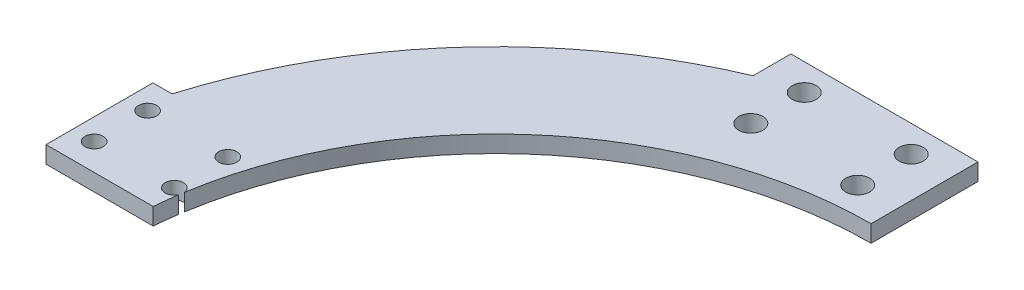
ISO-10303-21;
HEADER;
FILE_DESCRIPTION(('STEP AP214'),'2;1');
FILE_NAME('part.step','',(''),(''),'','','');
FILE_SCHEMA(('AUTOMOTIVE_DESIGN { 1 0 10303 214 1 1 1 1 }'));
ENDSEC;
DATA;
#1=APPLICATION_CONTEXT('core data for automotive mechanical design processes');
#2=APPLICATION_PROTOCOL_DEFINITION('international standard','automotive_design',2000,#1);
#3=PRODUCT_CONTEXT('',#1,'mechanical');
#4=PRODUCT('Part','Part','',(#3));
#5=PRODUCT_RELATED_PRODUCT_CATEGORY('part','',(#4));
#6=PRODUCT_DEFINITION_FORMATION('','',#4);
#7=PRODUCT_DEFINITION_CONTEXT('part definition',#1,'design');
#8=PRODUCT_DEFINITION('design','',#6,#7);
#9=PRODUCT_DEFINITION_SHAPE('','',#8);
#10=(LENGTH_UNIT() NAMED_UNIT(*) SI_UNIT(.MILLI.,.METRE.));
#11=(NAMED_UNIT(*) PLANE_ANGLE_UNIT() SI_UNIT($,.RADIAN.));
#12=(NAMED_UNIT(*) SI_UNIT($,.STERADIAN.) SOLID_ANGLE_UNIT());
#13=UNCERTAINTY_MEASURE_WITH_UNIT(LENGTH_MEASURE(1.E-05),#10,'distance_accuracy_value','');
#14=(GEOMETRIC_REPRESENTATION_CONTEXT(3) GLOBAL_UNCERTAINTY_ASSIGNED_CONTEXT((#13)) GLOBAL_UNIT_ASSIGNED_CONTEXT((#10,
#11,#12)) REPRESENTATION_CONTEXT('',''));
#15=CARTESIAN_POINT('',(0.,0.,0.));
#16=DIRECTION('',(0.,0.,1.));
#17=DIRECTION('',(1.,0.,0.));
#18=AXIS2_PLACEMENT_3D('',#15,#16,#17);
#19=CARTESIAN_POINT('',(0.,3.175,5.1666666666667));
#20=DIRECTION('',(0.,-1.,0.));
#21=DIRECTION('',(0.,0.,-1.));
#22=AXIS2_PLACEMENT_3D('',#19,#20,#21);
#23=CYLINDRICAL_SURFACE('',#22,70.1666666666667);
#24=DIRECTION('',(0.,-1.,0.));
#25=VECTOR('',#24,1.);
#26=CARTESIAN_POINT('',(-69.2937817250076,1.5875,-5.86659782568134));
#27=LINE('',#26,#25);
#28=CARTESIAN_POINT('',(-69.2937817250076,0.,-5.86659782568134));
#29=VERTEX_POINT('',#28);
#30=CARTESIAN_POINT('',(-69.2937817250076,3.175,-5.86659782568134));
#31=VERTEX_POINT('',#30);
#32=EDGE_CURVE('E117',#29,#31,#27,.F.);
#33=ORIENTED_EDGE('',*,*,#32,.F.);
#34=CARTESIAN_POINT('',(0.,0.,5.1666666666667));
#35=DIRECTION('',(0.,1.,0.));
#36=DIRECTION('',(0.,0.,1.));
#37=AXIS2_PLACEMENT_3D('',#34,#35,#36);
#38=CIRCLE('',#37,70.1666666666667);
#39=CARTESIAN_POINT('',(0.,0.,-65.));
#40=VERTEX_POINT('',#39);
#41=EDGE_CURVE('E158',#40,#29,#38,.T.);
#42=ORIENTED_EDGE('',*,*,#41,.F.);
#43=DIRECTION('',(0.,-1.,0.));
#44=VECTOR('',#43,1.);
#45=CARTESIAN_POINT('',(0.,3.175,-65.));
#46=LINE('',#45,#44);
#47=CARTESIAN_POINT('',(0.,3.175,-65.));
#48=VERTEX_POINT('',#47);
#49=EDGE_CURVE('E50',#48,#40,#46,.T.);
#50=ORIENTED_EDGE('',*,*,#49,.F.);
#51=CARTESIAN_POINT('',(0.,3.175,5.1666666666667));
#52=DIRECTION('',(0.,1.,0.));
#53=DIRECTION('',(0.,0.,1.));
#54=AXIS2_PLACEMENT_3D('',#51,#52,#53);
#55=CIRCLE('',#54,70.1666666666667);
#56=EDGE_CURVE('E134',#48,#31,#55,.T.);
#57=ORIENTED_EDGE('',*,*,#56,.T.);
#58=EDGE_LOOP('',(#33,#42,#50,#57));
#59=FACE_BOUND('',#58,.T.);
#60=ADVANCED_FACE('F41',(#59),#23,.F.);
#61=CARTESIAN_POINT('',(0.,3.175,5.1666666666667));
#62=DIRECTION('',(0.,-1.,0.));
#63=DIRECTION('',(0.,0.,-1.));
#64=AXIS2_PLACEMENT_3D('',#61,#62,#63);
#65=CYLINDRICAL_SURFACE('',#64,90.1666666666667);
#66=DIRECTION('',(0.,1.,0.));
#67=VECTOR('',#66,1.);
#68=CARTESIAN_POINT('',(-35.,-35.7069643370784,-77.9298301173601));
#69=LINE('',#68,#67);
#70=CARTESIAN_POINT('',(-35.,0.,-77.9298301173601));
#71=VERTEX_POINT('',#70);
#72=CARTESIAN_POINT('',(-35.,3.175,-77.9298301173601));
#73=VERTEX_POINT('',#72);
#74=EDGE_CURVE('E205',#71,#73,#69,.T.);
#75=ORIENTED_EDGE('',*,*,#74,.F.);
#76=CARTESIAN_POINT('',(0.,0.,5.1666666666667));
#77=DIRECTION('',(0.,1.,0.));
#78=DIRECTION('',(0.,0.,1.));
#79=AXIS2_PLACEMENT_3D('',#76,#77,#78);
#80=CIRCLE('',#79,90.1666666666667);
#81=CARTESIAN_POINT('',(-86.3933558558554,0.,-20.6444906444906));
#82=VERTEX_POINT('',#81);
#83=EDGE_CURVE('E166',#71,#82,#80,.T.);
#84=ORIENTED_EDGE('',*,*,#83,.T.);
#85=DIRECTION('',(0.,1.,0.));
#86=VECTOR('',#85,1.);
#87=CARTESIAN_POINT('',(-86.3933558558554,-35.7069643370784,-20.6444906444906));
#88=LINE('',#87,#86);
#89=CARTESIAN_POINT('',(-86.3933558558554,3.175,-20.6444906444906));
#90=VERTEX_POINT('',#89);
#91=EDGE_CURVE('E229',#82,#90,#88,.T.);
#92=ORIENTED_EDGE('',*,*,#91,.T.);
#93=CARTESIAN_POINT('',(0.,3.175,5.1666666666667));
#94=DIRECTION('',(0.,1.,0.));
#95=DIRECTION('',(0.,0.,1.));
#96=AXIS2_PLACEMENT_3D('',#93,#94,#95);
#97=CIRCLE('',#96,90.1666666666667);
#98=EDGE_CURVE('E64',#73,#90,#97,.T.);
#99=ORIENTED_EDGE('',*,*,#98,.F.);
#100=EDGE_LOOP('',(#75,#84,#92,#99));
#101=FACE_BOUND('',#100,.T.);
#102=ADVANCED_FACE('F243',(#101),#65,.T.);
#103=DIRECTION('',(0.,-1.,0.));
#104=VECTOR('',#103,1.);
#105=CARTESIAN_POINT('',(-69.4363375316292,1.5875,-4.93066670926843));
#106=LINE('',#105,#104);
#107=CARTESIAN_POINT('',(-69.4363375316292,3.175,-4.93066670926843));
#108=VERTEX_POINT('',#107);
#109=CARTESIAN_POINT('',(-69.4363375316292,0.,-4.93066670926844));
#110=VERTEX_POINT('',#109);
#111=EDGE_CURVE('E57',#108,#110,#106,.T.);
#112=ORIENTED_EDGE('',*,*,#111,.F.);
#113=CARTESIAN_POINT('',(-69.9256144900858,3.175,-0.644490644490637));
#114=VERTEX_POINT('',#113);
#115=EDGE_CURVE('E137',#108,#114,#55,.T.);
#116=ORIENTED_EDGE('',*,*,#115,.T.);
#117=DIRECTION('',(0.,-1.,0.));
#118=VECTOR('',#117,1.);
#119=CARTESIAN_POINT('',(-69.9256144900858,3.175,-0.644490644490637));
#120=LINE('',#119,#118);
#121=CARTESIAN_POINT('',(-69.9256144900858,0.,-0.644490644490637));
#122=VERTEX_POINT('',#121);
#123=EDGE_CURVE('E157',#114,#122,#120,.T.);
#124=ORIENTED_EDGE('',*,*,#123,.T.);
#125=EDGE_CURVE('E162',#110,#122,#38,.T.);
#126=ORIENTED_EDGE('',*,*,#125,.F.);
#127=EDGE_LOOP('',(#112,#116,#124,#126));
#128=FACE_BOUND('',#127,.T.);
#129=ADVANCED_FACE('F43',(#128),#23,.F.);
#130=CARTESIAN_POINT('',(0.,3.175,0.));
#131=DIRECTION('',(1.,0.,0.));
#132=DIRECTION('',(0.,0.,-1.));
#133=AXIS2_PLACEMENT_3D('',#130,#131,#132);
#134=PLANE('',#133);
#135=DIRECTION('',(0.,0.,1.));
#136=VECTOR('',#135,1.);
#137=CARTESIAN_POINT('',(0.,0.,0.));
#138=LINE('',#137,#136);
#139=CARTESIAN_POINT('',(0.,0.,-85.));
#140=VERTEX_POINT('',#139);
#141=EDGE_CURVE('E161',#140,#40,#138,.T.);
#142=ORIENTED_EDGE('',*,*,#141,.F.);
#143=DIRECTION('',(0.,-1.,0.));
#144=VECTOR('',#143,1.);
#145=CARTESIAN_POINT('',(0.,3.175,-85.));
#146=LINE('',#145,#144);
#147=CARTESIAN_POINT('',(0.,3.175,-85.));
#148=VERTEX_POINT('',#147);
#149=EDGE_CURVE('E179',#148,#140,#146,.T.);
#150=ORIENTED_EDGE('',*,*,#149,.F.);
#151=DIRECTION('',(0.,0.,1.));
#152=VECTOR('',#151,1.);
#153=CARTESIAN_POINT('',(0.,3.175,0.));
#154=LINE('',#153,#152);
#155=EDGE_CURVE('E142',#148,#48,#154,.T.);
#156=ORIENTED_EDGE('',*,*,#155,.T.);
#157=ORIENTED_EDGE('',*,*,#49,.T.);
#158=EDGE_LOOP('',(#142,#150,#156,#157));
#159=FACE_BOUND('',#158,.T.);
#160=ADVANCED_FACE('F184',(#159),#134,.T.);
#161=CARTESIAN_POINT('',(0.,3.175,-0.644490644490652));
#162=DIRECTION('',(0.,0.,-1.));
#163=DIRECTION('',(-1.,0.,0.));
#164=AXIS2_PLACEMENT_3D('',#161,#162,#163);
#165=PLANE('',#164);
#166=DIRECTION('',(1.,0.,0.));
#167=VECTOR('',#166,1.);
#168=CARTESIAN_POINT('',(0.,0.,-0.644490644490652));
#169=LINE('',#168,#167);
#170=CARTESIAN_POINT('',(-89.97920997921,0.,-0.644490644490633));
#171=VERTEX_POINT('',#170);
#172=EDGE_CURVE('E147',#171,#122,#169,.T.);
#173=ORIENTED_EDGE('',*,*,#172,.T.);
#174=ORIENTED_EDGE('',*,*,#123,.F.);
#175=DIRECTION('',(1.,0.,0.));
#176=VECTOR('',#175,1.);
#177=CARTESIAN_POINT('',(0.,3.175,-0.644490644490652));
#178=LINE('',#177,#176);
#179=CARTESIAN_POINT('',(-89.97920997921,3.175,-0.644490644490633));
#180=VERTEX_POINT('',#179);
#181=EDGE_CURVE('E154',#180,#114,#178,.T.);
#182=ORIENTED_EDGE('',*,*,#181,.F.);
#183=DIRECTION('',(0.,-1.,0.));
#184=VECTOR('',#183,1.);
#185=CARTESIAN_POINT('',(-89.97920997921,3.175,-0.644490644490633));
#186=LINE('',#185,#184);
#187=EDGE_CURVE('E175',#180,#171,#186,.T.);
#188=ORIENTED_EDGE('',*,*,#187,.T.);
#189=EDGE_LOOP('',(#173,#174,#182,#188));
#190=FACE_BOUND('',#189,.T.);
#191=ADVANCED_FACE('F250',(#190),#165,.F.);
#192=CARTESIAN_POINT('',(0.,3.175,0.));
#193=DIRECTION('',(0.,1.,0.));
#194=DIRECTION('',(0.,0.,1.));
#195=AXIS2_PLACEMENT_3D('',#192,#193,#194);
#196=PLANE('',#195);
#197=CARTESIAN_POINT('',(-70.97920997921,3.175,-5.64449064449063));
#198=DIRECTION('',(0.,-1.,0.));
#199=DIRECTION('',(0.,0.,-1.));
#200=AXIS2_PLACEMENT_3D('',#197,#198,#199);
#201=CIRCLE('',#200,1.7);
#202=EDGE_CURVE('E120',#108,#31,#201,.T.);
#203=ORIENTED_EDGE('',*,*,#202,.T.);
#204=ORIENTED_EDGE('',*,*,#56,.F.);
#205=ORIENTED_EDGE('',*,*,#155,.F.);
#206=DIRECTION('',(-1.,0.,0.));
#207=VECTOR('',#206,1.);
#208=CARTESIAN_POINT('',(0.,3.175,-85.));
#209=LINE('',#208,#207);
#210=CARTESIAN_POINT('',(-35.,3.175,-85.));
#211=VERTEX_POINT('',#210);
#212=EDGE_CURVE('E200',#148,#211,#209,.T.);
#213=ORIENTED_EDGE('',*,*,#212,.T.);
#214=DIRECTION('',(0.,0.,-1.));
#215=VECTOR('',#214,1.);
#216=CARTESIAN_POINT('',(-35.,3.175,0.));
#217=LINE('',#216,#215);
#218=EDGE_CURVE('E203',#73,#211,#217,.T.);
#219=ORIENTED_EDGE('',*,*,#218,.F.);
#220=ORIENTED_EDGE('',*,*,#98,.T.);
#221=DIRECTION('',(1.,0.,0.));
#222=VECTOR('',#221,1.);
#223=CARTESIAN_POINT('',(0.,3.175,-20.6444906444906));
#224=LINE('',#223,#222);
#225=CARTESIAN_POINT('',(-89.97920997921,3.175,-20.6444906444906));
#226=VERTEX_POINT('',#225);
#227=EDGE_CURVE('E220',#226,#90,#224,.T.);
#228=ORIENTED_EDGE('',*,*,#227,.F.);
#229=DIRECTION('',(0.,0.,-1.));
#230=VECTOR('',#229,1.);
#231=CARTESIAN_POINT('',(-89.97920997921,3.175,0.));
#232=LINE('',#231,#230);
#233=EDGE_CURVE('E224',#180,#226,#232,.T.);
#234=ORIENTED_EDGE('',*,*,#233,.F.);
#235=ORIENTED_EDGE('',*,*,#181,.T.);
#236=ORIENTED_EDGE('',*,*,#115,.F.);
#237=EDGE_LOOP('',(#203,#204,#205,#213,#219,#220,#228,#234,#235,#236));
#238=FACE_BOUND('',#237,.T.);
#239=CARTESIAN_POINT('',(-85.97920997921,3.175,-5.64449064449063));
#240=DIRECTION('',(0.,-1.,0.));
#241=DIRECTION('',(0.,0.,-1.));
#242=AXIS2_PLACEMENT_3D('',#239,#240,#241);
#243=CIRCLE('',#242,1.7);
#244=CARTESIAN_POINT('',(-85.97920997921,3.175,-7.34449064449063));
#245=VERTEX_POINT('',#244);
#246=EDGE_CURVE('E468',#245,#245,#243,.T.);
#247=ORIENTED_EDGE('',*,*,#246,.T.);
#248=EDGE_LOOP('',(#247));
#249=FACE_BOUND('',#248,.T.);
#250=CARTESIAN_POINT('',(-85.97920997921,3.175,-15.6444906444906));
#251=DIRECTION('',(0.,-1.,0.));
#252=DIRECTION('',(0.,0.,-1.));
#253=AXIS2_PLACEMENT_3D('',#250,#251,#252);
#254=CIRCLE('',#253,1.7);
#255=CARTESIAN_POINT('',(-85.97920997921,3.175,-17.3444906444906));
#256=VERTEX_POINT('',#255);
#257=EDGE_CURVE('E462',#256,#256,#254,.T.);
#258=ORIENTED_EDGE('',*,*,#257,.T.);
#259=EDGE_LOOP('',(#258));
#260=FACE_BOUND('',#259,.T.);
#261=CARTESIAN_POINT('',(-70.97920997921,3.175,-15.6444906444906));
#262=DIRECTION('',(0.,-1.,0.));
#263=DIRECTION('',(0.,0.,-1.));
#264=AXIS2_PLACEMENT_3D('',#261,#262,#263);
#265=CIRCLE('',#264,1.7);
#266=CARTESIAN_POINT('',(-70.97920997921,3.175,-17.3444906444906));
#267=VERTEX_POINT('',#266);
#268=EDGE_CURVE('E459',#267,#267,#265,.T.);
#269=ORIENTED_EDGE('',*,*,#268,.T.);
#270=EDGE_LOOP('',(#269));
#271=FACE_BOUND('',#270,.T.);
#272=CARTESIAN_POINT('',(-27.5,3.175,-70.));
#273=DIRECTION('',(0.,-1.,0.));
#274=DIRECTION('',(0.,0.,-1.));
#275=AXIS2_PLACEMENT_3D('',#272,#273,#274);
#276=CIRCLE('',#275,2.25);
#277=CARTESIAN_POINT('',(-27.5,3.175,-72.25));
#278=VERTEX_POINT('',#277);
#279=EDGE_CURVE('E451',#278,#278,#276,.T.);
#280=ORIENTED_EDGE('',*,*,#279,.T.);
#281=EDGE_LOOP('',(#280));
#282=FACE_BOUND('',#281,.T.);
#283=CARTESIAN_POINT('',(-7.50000000000001,3.175,-80.));
#284=DIRECTION('',(0.,-1.,0.));
#285=DIRECTION('',(0.,0.,-1.));
#286=AXIS2_PLACEMENT_3D('',#283,#284,#285);
#287=CIRCLE('',#286,2.25);
#288=CARTESIAN_POINT('',(-7.50000000000001,3.175,-82.25));
#289=VERTEX_POINT('',#288);
#290=EDGE_CURVE('E445',#289,#289,#287,.T.);
#291=ORIENTED_EDGE('',*,*,#290,.T.);
#292=EDGE_LOOP('',(#291));
#293=FACE_BOUND('',#292,.T.);
#294=CARTESIAN_POINT('',(-27.5,3.175,-80.));
#295=DIRECTION('',(0.,-1.,0.));
#296=DIRECTION('',(0.,0.,-1.));
#297=AXIS2_PLACEMENT_3D('',#294,#295,#296);
#298=CIRCLE('',#297,2.25);
#299=CARTESIAN_POINT('',(-27.5,3.175,-82.25));
#300=VERTEX_POINT('',#299);
#301=EDGE_CURVE('E433',#300,#300,#298,.T.);
#302=ORIENTED_EDGE('',*,*,#301,.T.);
#303=EDGE_LOOP('',(#302));
#304=FACE_BOUND('',#303,.T.);
#305=CARTESIAN_POINT('',(-7.50000000000001,3.175,-70.));
#306=DIRECTION('',(0.,-1.,0.));
#307=DIRECTION('',(0.,0.,-1.));
#308=AXIS2_PLACEMENT_3D('',#305,#306,#307);
#309=CIRCLE('',#308,2.25);
#310=CARTESIAN_POINT('',(-7.50000000000001,3.175,-72.25));
#311=VERTEX_POINT('',#310);
#312=EDGE_CURVE('E210',#311,#311,#309,.T.);
#313=ORIENTED_EDGE('',*,*,#312,.T.);
#314=EDGE_LOOP('',(#313));
#315=FACE_BOUND('',#314,.T.);
#316=ADVANCED_FACE('F131',(#238,#249,#260,#271,#282,#293,#304,#315),#196,.T.);
#317=CARTESIAN_POINT('',(0.,0.,0.));
#318=DIRECTION('',(0.,1.,0.));
#319=DIRECTION('',(0.,0.,1.));
#320=AXIS2_PLACEMENT_3D('',#317,#318,#319);
#321=PLANE('',#320);
#322=CARTESIAN_POINT('',(-85.97920997921,0.,-5.64449064449063));
#323=DIRECTION('',(0.,-1.,0.));
#324=DIRECTION('',(0.,0.,-1.));
#325=AXIS2_PLACEMENT_3D('',#322,#323,#324);
#326=CIRCLE('',#325,1.7);
#327=CARTESIAN_POINT('',(-85.97920997921,0.,-7.34449064449063));
#328=VERTEX_POINT('',#327);
#329=EDGE_CURVE('E139',#328,#328,#326,.T.);
#330=ORIENTED_EDGE('',*,*,#329,.F.);
#331=EDGE_LOOP('',(#330));
#332=FACE_BOUND('',#331,.T.);
#333=CARTESIAN_POINT('',(-85.97920997921,0.,-15.6444906444906));
#334=DIRECTION('',(0.,-1.,0.));
#335=DIRECTION('',(0.,0.,-1.));
#336=AXIS2_PLACEMENT_3D('',#333,#334,#335);
#337=CIRCLE('',#336,1.7);
#338=CARTESIAN_POINT('',(-85.97920997921,0.,-17.3444906444906));
#339=VERTEX_POINT('',#338);
#340=EDGE_CURVE('E412',#339,#339,#337,.T.);
#341=ORIENTED_EDGE('',*,*,#340,.F.);
#342=EDGE_LOOP('',(#341));
#343=FACE_BOUND('',#342,.T.);
#344=CARTESIAN_POINT('',(-70.97920997921,0.,-15.6444906444906));
#345=DIRECTION('',(0.,-1.,0.));
#346=DIRECTION('',(0.,0.,-1.));
#347=AXIS2_PLACEMENT_3D('',#344,#345,#346);
#348=CIRCLE('',#347,1.7);
#349=CARTESIAN_POINT('',(-70.97920997921,0.,-17.3444906444906));
#350=VERTEX_POINT('',#349);
#351=EDGE_CURVE('E416',#350,#350,#348,.T.);
#352=ORIENTED_EDGE('',*,*,#351,.F.);
#353=EDGE_LOOP('',(#352));
#354=FACE_BOUND('',#353,.T.);
#355=CARTESIAN_POINT('',(-27.5,0.,-70.));
#356=DIRECTION('',(0.,-1.,0.));
#357=DIRECTION('',(0.,0.,-1.));
#358=AXIS2_PLACEMENT_3D('',#355,#356,#357);
#359=CIRCLE('',#358,2.25);
#360=CARTESIAN_POINT('',(-27.5,0.,-72.25));
#361=VERTEX_POINT('',#360);
#362=EDGE_CURVE('E126',#361,#361,#359,.T.);
#363=ORIENTED_EDGE('',*,*,#362,.F.);
#364=EDGE_LOOP('',(#363));
#365=FACE_BOUND('',#364,.T.);
#366=CARTESIAN_POINT('',(-7.50000000000001,0.,-80.));
#367=DIRECTION('',(0.,-1.,0.));
#368=DIRECTION('',(0.,0.,-1.));
#369=AXIS2_PLACEMENT_3D('',#366,#367,#368);
#370=CIRCLE('',#369,2.25);
#371=CARTESIAN_POINT('',(-7.50000000000001,0.,-82.25));
#372=VERTEX_POINT('',#371);
#373=EDGE_CURVE('E423',#372,#372,#370,.T.);
#374=ORIENTED_EDGE('',*,*,#373,.F.);
#375=EDGE_LOOP('',(#374));
#376=FACE_BOUND('',#375,.T.);
#377=CARTESIAN_POINT('',(-27.5,0.,-80.));
#378=DIRECTION('',(0.,-1.,0.));
#379=DIRECTION('',(0.,0.,-1.));
#380=AXIS2_PLACEMENT_3D('',#377,#378,#379);
#381=CIRCLE('',#380,2.25);
#382=CARTESIAN_POINT('',(-27.5,0.,-82.25));
#383=VERTEX_POINT('',#382);
#384=EDGE_CURVE('E427',#383,#383,#381,.T.);
#385=ORIENTED_EDGE('',*,*,#384,.F.);
#386=EDGE_LOOP('',(#385));
#387=FACE_BOUND('',#386,.T.);
#388=CARTESIAN_POINT('',(-7.50000000000001,0.,-70.));
#389=DIRECTION('',(0.,-1.,0.));
#390=DIRECTION('',(0.,0.,-1.));
#391=AXIS2_PLACEMENT_3D('',#388,#389,#390);
#392=CIRCLE('',#391,2.25);
#393=CARTESIAN_POINT('',(-7.50000000000001,0.,-72.25));
#394=VERTEX_POINT('',#393);
#395=EDGE_CURVE('E430',#394,#394,#392,.T.);
#396=ORIENTED_EDGE('',*,*,#395,.F.);
#397=EDGE_LOOP('',(#396));
#398=FACE_BOUND('',#397,.T.);
#399=ORIENTED_EDGE('',*,*,#41,.T.);
#400=CARTESIAN_POINT('',(-70.97920997921,0.,-5.64449064449063));
#401=DIRECTION('',(0.,1.,0.));
#402=DIRECTION('',(0.,0.,1.));
#403=AXIS2_PLACEMENT_3D('',#400,#401,#402);
#404=CIRCLE('',#403,1.7);
#405=EDGE_CURVE('E11',#29,#110,#404,.T.);
#406=ORIENTED_EDGE('',*,*,#405,.T.);
#407=ORIENTED_EDGE('',*,*,#125,.T.);
#408=ORIENTED_EDGE('',*,*,#172,.F.);
#409=DIRECTION('',(0.,0.,1.));
#410=VECTOR('',#409,1.);
#411=CARTESIAN_POINT('',(-89.97920997921,0.,0.));
#412=LINE('',#411,#410);
#413=CARTESIAN_POINT('',(-89.97920997921,0.,-20.6444906444906));
#414=VERTEX_POINT('',#413);
#415=EDGE_CURVE('E149',#414,#171,#412,.T.);
#416=ORIENTED_EDGE('',*,*,#415,.F.);
#417=DIRECTION('',(-1.,0.,0.));
#418=VECTOR('',#417,1.);
#419=CARTESIAN_POINT('',(0.,0.,-20.6444906444906));
#420=LINE('',#419,#418);
#421=EDGE_CURVE('E216',#82,#414,#420,.T.);
#422=ORIENTED_EDGE('',*,*,#421,.F.);
#423=ORIENTED_EDGE('',*,*,#83,.F.);
#424=DIRECTION('',(0.,0.,1.));
#425=VECTOR('',#424,1.);
#426=CARTESIAN_POINT('',(-35.,0.,0.));
#427=LINE('',#426,#425);
#428=CARTESIAN_POINT('',(-35.,0.,-85.));
#429=VERTEX_POINT('',#428);
#430=EDGE_CURVE('E191',#429,#71,#427,.T.);
#431=ORIENTED_EDGE('',*,*,#430,.F.);
#432=DIRECTION('',(1.,0.,0.));
#433=VECTOR('',#432,1.);
#434=CARTESIAN_POINT('',(0.,0.,-85.));
#435=LINE('',#434,#433);
#436=EDGE_CURVE('E189',#429,#140,#435,.T.);
#437=ORIENTED_EDGE('',*,*,#436,.T.);
#438=ORIENTED_EDGE('',*,*,#141,.T.);
#439=EDGE_LOOP('',(#399,#406,#407,#408,#416,#422,#423,#431,#437,#438));
#440=FACE_BOUND('',#439,.T.);
#441=ADVANCED_FACE('F187',(#332,#343,#354,#365,#376,#387,#398,#440),#321,.F.);
#442=CARTESIAN_POINT('',(-89.97920997921,-35.7069643370784,0.));
#443=DIRECTION('',(1.,0.,0.));
#444=DIRECTION('',(0.,0.,-1.));
#445=AXIS2_PLACEMENT_3D('',#442,#443,#444);
#446=PLANE('',#445);
#447=DIRECTION('',(0.,1.,0.));
#448=VECTOR('',#447,1.);
#449=CARTESIAN_POINT('',(-89.97920997921,-35.7069643370784,-20.6444906444906));
#450=LINE('',#449,#448);
#451=EDGE_CURVE('E228',#414,#226,#450,.T.);
#452=ORIENTED_EDGE('',*,*,#451,.F.);
#453=ORIENTED_EDGE('',*,*,#415,.T.);
#454=ORIENTED_EDGE('',*,*,#187,.F.);
#455=ORIENTED_EDGE('',*,*,#233,.T.);
#456=EDGE_LOOP('',(#452,#453,#454,#455));
#457=FACE_BOUND('',#456,.T.);
#458=ADVANCED_FACE('F242',(#457),#446,.F.);
#459=CARTESIAN_POINT('',(0.,-35.7069643370784,-20.6444906444906));
#460=DIRECTION('',(0.,0.,1.));
#461=DIRECTION('',(1.,0.,0.));
#462=AXIS2_PLACEMENT_3D('',#459,#460,#461);
#463=PLANE('',#462);
#464=ORIENTED_EDGE('',*,*,#91,.F.);
#465=ORIENTED_EDGE('',*,*,#421,.T.);
#466=ORIENTED_EDGE('',*,*,#451,.T.);
#467=ORIENTED_EDGE('',*,*,#227,.T.);
#468=EDGE_LOOP('',(#464,#465,#466,#467));
#469=FACE_BOUND('',#468,.T.);
#470=ADVANCED_FACE('F235',(#469),#463,.F.);
#471=CARTESIAN_POINT('',(0.,-35.7069643370784,-85.));
#472=DIRECTION('',(0.,0.,-1.));
#473=DIRECTION('',(-1.,0.,0.));
#474=AXIS2_PLACEMENT_3D('',#471,#472,#473);
#475=PLANE('',#474);
#476=ORIENTED_EDGE('',*,*,#436,.F.);
#477=DIRECTION('',(0.,1.,0.));
#478=VECTOR('',#477,1.);
#479=CARTESIAN_POINT('',(-35.,-35.7069643370784,-85.));
#480=LINE('',#479,#478);
#481=EDGE_CURVE('E195',#429,#211,#480,.T.);
#482=ORIENTED_EDGE('',*,*,#481,.T.);
#483=ORIENTED_EDGE('',*,*,#212,.F.);
#484=ORIENTED_EDGE('',*,*,#149,.T.);
#485=EDGE_LOOP('',(#476,#482,#483,#484));
#486=FACE_BOUND('',#485,.T.);
#487=ADVANCED_FACE('F198',(#486),#475,.T.);
#488=CARTESIAN_POINT('',(-35.,-35.7069643370784,0.));
#489=DIRECTION('',(1.,0.,0.));
#490=DIRECTION('',(0.,0.,-1.));
#491=AXIS2_PLACEMENT_3D('',#488,#489,#490);
#492=PLANE('',#491);
#493=ORIENTED_EDGE('',*,*,#481,.F.);
#494=ORIENTED_EDGE('',*,*,#430,.T.);
#495=ORIENTED_EDGE('',*,*,#74,.T.);
#496=ORIENTED_EDGE('',*,*,#218,.T.);
#497=EDGE_LOOP('',(#493,#494,#495,#496));
#498=FACE_BOUND('',#497,.T.);
#499=ADVANCED_FACE('F308',(#498),#492,.F.);
#500=CARTESIAN_POINT('',(-7.50000000000001,0.,-70.));
#501=DIRECTION('',(0.,-1.,0.));
#502=DIRECTION('',(0.,0.,-1.));
#503=AXIS2_PLACEMENT_3D('',#500,#501,#502);
#504=CYLINDRICAL_SURFACE('',#503,2.25);
#505=ORIENTED_EDGE('',*,*,#312,.F.);
#506=EDGE_LOOP('',(#505));
#507=FACE_BOUND('',#506,.T.);
#508=ORIENTED_EDGE('',*,*,#395,.T.);
#509=EDGE_LOOP('',(#508));
#510=FACE_BOUND('',#509,.T.);
#511=ADVANCED_FACE('F317',(#507,#510),#504,.F.);
#512=CARTESIAN_POINT('',(-27.5,0.,-80.));
#513=DIRECTION('',(0.,-1.,0.));
#514=DIRECTION('',(0.,0.,-1.));
#515=AXIS2_PLACEMENT_3D('',#512,#513,#514);
#516=CYLINDRICAL_SURFACE('',#515,2.25);
#517=ORIENTED_EDGE('',*,*,#301,.F.);
#518=EDGE_LOOP('',(#517));
#519=FACE_BOUND('',#518,.T.);
#520=ORIENTED_EDGE('',*,*,#384,.T.);
#521=EDGE_LOOP('',(#520));
#522=FACE_BOUND('',#521,.T.);
#523=ADVANCED_FACE('F327',(#519,#522),#516,.F.);
#524=CARTESIAN_POINT('',(-7.50000000000001,0.,-80.));
#525=DIRECTION('',(0.,-1.,0.));
#526=DIRECTION('',(0.,0.,-1.));
#527=AXIS2_PLACEMENT_3D('',#524,#525,#526);
#528=CYLINDRICAL_SURFACE('',#527,2.25);
#529=ORIENTED_EDGE('',*,*,#290,.F.);
#530=EDGE_LOOP('',(#529));
#531=FACE_BOUND('',#530,.T.);
#532=ORIENTED_EDGE('',*,*,#373,.T.);
#533=EDGE_LOOP('',(#532));
#534=FACE_BOUND('',#533,.T.);
#535=ADVANCED_FACE('F337',(#531,#534),#528,.F.);
#536=CARTESIAN_POINT('',(-27.5,0.,-70.));
#537=DIRECTION('',(0.,-1.,0.));
#538=DIRECTION('',(0.,0.,-1.));
#539=AXIS2_PLACEMENT_3D('',#536,#537,#538);
#540=CYLINDRICAL_SURFACE('',#539,2.25);
#541=ORIENTED_EDGE('',*,*,#279,.F.);
#542=EDGE_LOOP('',(#541));
#543=FACE_BOUND('',#542,.T.);
#544=ORIENTED_EDGE('',*,*,#362,.T.);
#545=EDGE_LOOP('',(#544));
#546=FACE_BOUND('',#545,.T.);
#547=ADVANCED_FACE('F347',(#543,#546),#540,.F.);
#548=CARTESIAN_POINT('',(-70.97920997921,3.175,-15.6444906444906));
#549=DIRECTION('',(0.,-1.,0.));
#550=DIRECTION('',(0.,0.,-1.));
#551=AXIS2_PLACEMENT_3D('',#548,#549,#550);
#552=CYLINDRICAL_SURFACE('',#551,1.7);
#553=ORIENTED_EDGE('',*,*,#268,.F.);
#554=EDGE_LOOP('',(#553));
#555=FACE_BOUND('',#554,.T.);
#556=ORIENTED_EDGE('',*,*,#351,.T.);
#557=EDGE_LOOP('',(#556));
#558=FACE_BOUND('',#557,.T.);
#559=ADVANCED_FACE('F356',(#555,#558),#552,.F.);
#560=CARTESIAN_POINT('',(-85.97920997921,3.175,-15.6444906444906));
#561=DIRECTION('',(0.,-1.,0.));
#562=DIRECTION('',(0.,0.,-1.));
#563=AXIS2_PLACEMENT_3D('',#560,#561,#562);
#564=CYLINDRICAL_SURFACE('',#563,1.7);
#565=ORIENTED_EDGE('',*,*,#257,.F.);
#566=EDGE_LOOP('',(#565));
#567=FACE_BOUND('',#566,.T.);
#568=ORIENTED_EDGE('',*,*,#340,.T.);
#569=EDGE_LOOP('',(#568));
#570=FACE_BOUND('',#569,.T.);
#571=ADVANCED_FACE('F372',(#567,#570),#564,.F.);
#572=CARTESIAN_POINT('',(-85.97920997921,3.175,-5.64449064449063));
#573=DIRECTION('',(0.,-1.,0.));
#574=DIRECTION('',(0.,0.,-1.));
#575=AXIS2_PLACEMENT_3D('',#572,#573,#574);
#576=CYLINDRICAL_SURFACE('',#575,1.7);
#577=ORIENTED_EDGE('',*,*,#246,.F.);
#578=EDGE_LOOP('',(#577));
#579=FACE_BOUND('',#578,.T.);
#580=ORIENTED_EDGE('',*,*,#329,.T.);
#581=EDGE_LOOP('',(#580));
#582=FACE_BOUND('',#581,.T.);
#583=ADVANCED_FACE('F382',(#579,#582),#576,.F.);
#584=CARTESIAN_POINT('',(-70.97920997921,3.175,-5.64449064449063));
#585=DIRECTION('',(0.,-1.,0.));
#586=DIRECTION('',(0.,0.,-1.));
#587=AXIS2_PLACEMENT_3D('',#584,#585,#586);
#588=CYLINDRICAL_SURFACE('',#587,1.7);
#589=ORIENTED_EDGE('',*,*,#32,.T.);
#590=ORIENTED_EDGE('',*,*,#202,.F.);
#591=ORIENTED_EDGE('',*,*,#111,.T.);
#592=ORIENTED_EDGE('',*,*,#405,.F.);
#593=EDGE_LOOP('',(#589,#590,#591,#592));
#594=FACE_BOUND('',#593,.T.);
#595=ADVANCED_FACE('F119',(#594),#588,.F.);
#596=CLOSED_SHELL('',(#60,#102,#129,#160,#191,#316,#441,#458,#470,#487,#499,#511,#523,#535,#547,
#559,#571,#583,#595));
#597=MANIFOLD_SOLID_BREP('B2',#596);
#598=ADVANCED_BREP_SHAPE_REPRESENTATION('',(#18,#597),#14);
#599=SHAPE_DEFINITION_REPRESENTATION(#9,#598);
ENDSEC;
END-ISO-10303-21;
